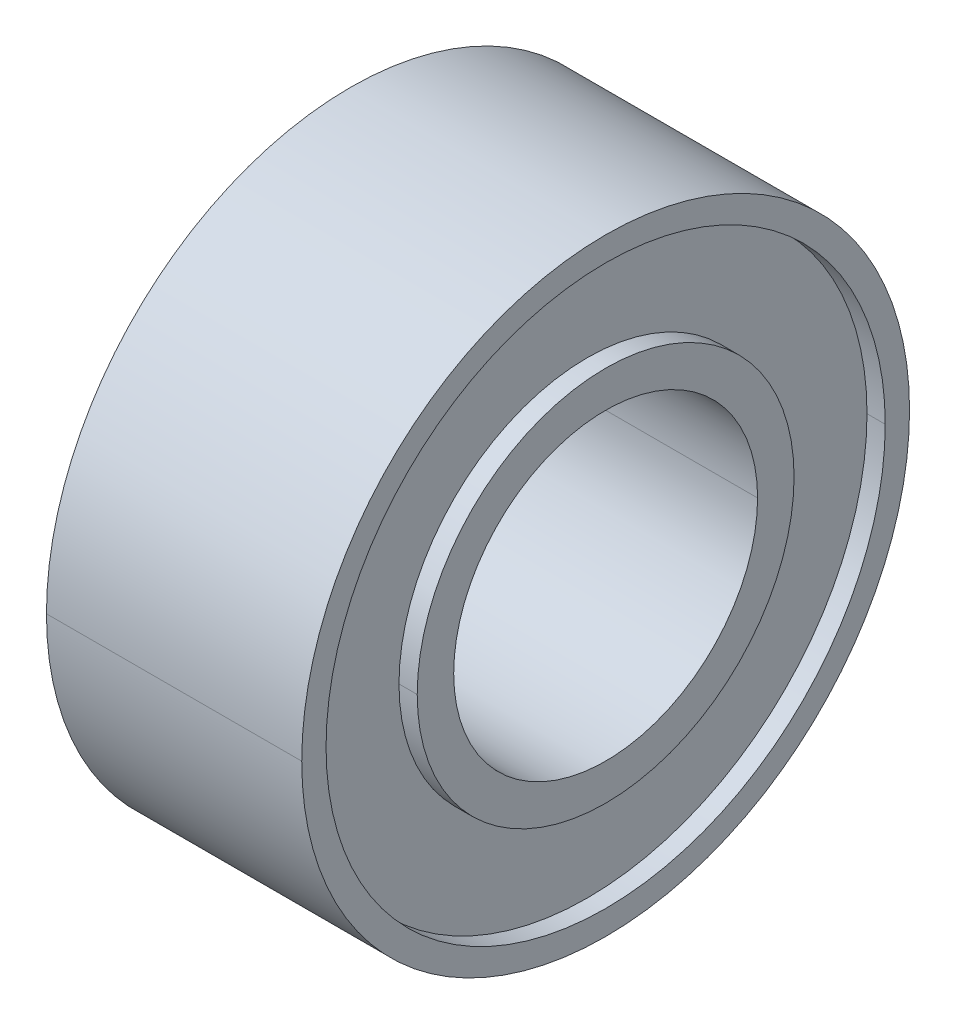
ISO-10303-21;
HEADER;
FILE_DESCRIPTION(('STEP AP214'),'2;1');
FILE_NAME('part.step','',(''),(''),'','','');
FILE_SCHEMA(('AUTOMOTIVE_DESIGN { 1 0 10303 214 1 1 1 1 }'));
ENDSEC;
DATA;
#1=APPLICATION_CONTEXT('core data for automotive mechanical design processes');
#2=APPLICATION_PROTOCOL_DEFINITION('international standard','automotive_design',2000,#1);
#3=PRODUCT_CONTEXT('',#1,'mechanical');
#4=PRODUCT('Part','Part','',(#3));
#5=PRODUCT_RELATED_PRODUCT_CATEGORY('part','',(#4));
#6=PRODUCT_DEFINITION_FORMATION('','',#4);
#7=PRODUCT_DEFINITION_CONTEXT('part definition',#1,'design');
#8=PRODUCT_DEFINITION('design','',#6,#7);
#9=PRODUCT_DEFINITION_SHAPE('','',#8);
#10=(LENGTH_UNIT() NAMED_UNIT(*) SI_UNIT(.MILLI.,.METRE.));
#11=(NAMED_UNIT(*) PLANE_ANGLE_UNIT() SI_UNIT($,.RADIAN.));
#12=(NAMED_UNIT(*) SI_UNIT($,.STERADIAN.) SOLID_ANGLE_UNIT());
#13=UNCERTAINTY_MEASURE_WITH_UNIT(LENGTH_MEASURE(1.E-05),#10,'distance_accuracy_value','');
#14=(GEOMETRIC_REPRESENTATION_CONTEXT(3) GLOBAL_UNCERTAINTY_ASSIGNED_CONTEXT((#13)) GLOBAL_UNIT_ASSIGNED_CONTEXT((#10,
#11,#12)) REPRESENTATION_CONTEXT('',''));
#15=CARTESIAN_POINT('',(0.,0.,0.));
#16=DIRECTION('',(0.,0.,1.));
#17=DIRECTION('',(1.,0.,0.));
#18=AXIS2_PLACEMENT_3D('',#15,#16,#17);
#19=CARTESIAN_POINT('',(0.,0.,0.));
#20=DIRECTION('',(1.,0.,0.));
#21=DIRECTION('',(0.,0.,-1.));
#22=AXIS2_PLACEMENT_3D('',#19,#20,#21);
#23=CYLINDRICAL_SURFACE('',#22,2.5);
#24=DIRECTION('',(1.,0.,0.));
#25=VECTOR('',#24,1.);
#26=CARTESIAN_POINT('',(0.,0.,2.5));
#27=LINE('',#26,#25);
#28=CARTESIAN_POINT('',(-2.1,0.,2.5));
#29=VERTEX_POINT('',#28);
#30=CARTESIAN_POINT('',(2.1,0.,2.5));
#31=VERTEX_POINT('',#30);
#32=EDGE_CURVE('E166',#29,#31,#27,.T.);
#33=ORIENTED_EDGE('',*,*,#32,.F.);
#34=CARTESIAN_POINT('',(-2.1,0.,0.));
#35=DIRECTION('',(1.,0.,0.));
#36=DIRECTION('',(0.,0.,-1.));
#37=AXIS2_PLACEMENT_3D('',#34,#35,#36);
#38=CIRCLE('',#37,2.5);
#39=CARTESIAN_POINT('',(-2.1,0.,-2.5));
#40=VERTEX_POINT('',#39);
#41=EDGE_CURVE('E188',#40,#29,#38,.T.);
#42=ORIENTED_EDGE('',*,*,#41,.F.);
#43=DIRECTION('',(1.,0.,0.));
#44=VECTOR('',#43,1.);
#45=CARTESIAN_POINT('',(0.,0.,-2.5));
#46=LINE('',#45,#44);
#47=CARTESIAN_POINT('',(2.1,0.,-2.5));
#48=VERTEX_POINT('',#47);
#49=EDGE_CURVE('E129',#40,#48,#46,.T.);
#50=ORIENTED_EDGE('',*,*,#49,.T.);
#51=CARTESIAN_POINT('',(2.1,0.,0.));
#52=DIRECTION('',(1.,0.,0.));
#53=DIRECTION('',(0.,0.,-1.));
#54=AXIS2_PLACEMENT_3D('',#51,#52,#53);
#55=CIRCLE('',#54,2.5);
#56=EDGE_CURVE('E11',#48,#31,#55,.T.);
#57=ORIENTED_EDGE('',*,*,#56,.T.);
#58=EDGE_LOOP('',(#33,#42,#50,#57));
#59=FACE_BOUND('',#58,.T.);
#60=ADVANCED_FACE('F17',(#59),#23,.F.);
#61=CARTESIAN_POINT('',(2.1,2.5,0.));
#62=DIRECTION('',(1.,0.,0.));
#63=DIRECTION('',(0.,1.,0.));
#64=AXIS2_PLACEMENT_3D('',#61,#62,#63);
#65=PLANE('',#64);
#66=ORIENTED_EDGE('',*,*,#56,.F.);
#67=CARTESIAN_POINT('',(2.1,0.,0.));
#68=DIRECTION('',(1.,0.,0.));
#69=DIRECTION('',(0.,0.,-1.));
#70=AXIS2_PLACEMENT_3D('',#67,#68,#69);
#71=CIRCLE('',#70,2.5);
#72=EDGE_CURVE('E137',#31,#48,#71,.T.);
#73=ORIENTED_EDGE('',*,*,#72,.F.);
#74=EDGE_LOOP('',(#66,#73));
#75=FACE_BOUND('',#74,.T.);
#76=CARTESIAN_POINT('',(2.1,0.,0.));
#77=DIRECTION('',(1.,0.,0.));
#78=DIRECTION('',(0.,0.,-1.));
#79=AXIS2_PLACEMENT_3D('',#76,#77,#78);
#80=CIRCLE('',#79,3.1);
#81=CARTESIAN_POINT('',(2.1,0.,-3.1));
#82=VERTEX_POINT('',#81);
#83=CARTESIAN_POINT('',(2.1,0.,3.1));
#84=VERTEX_POINT('',#83);
#85=EDGE_CURVE('E122',#82,#84,#80,.T.);
#86=ORIENTED_EDGE('',*,*,#85,.T.);
#87=CARTESIAN_POINT('',(2.1,0.,0.));
#88=DIRECTION('',(1.,0.,0.));
#89=DIRECTION('',(0.,0.,-1.));
#90=AXIS2_PLACEMENT_3D('',#87,#88,#89);
#91=CIRCLE('',#90,3.1);
#92=EDGE_CURVE('E27',#84,#82,#91,.T.);
#93=ORIENTED_EDGE('',*,*,#92,.T.);
#94=EDGE_LOOP('',(#86,#93));
#95=FACE_BOUND('',#94,.T.);
#96=ADVANCED_FACE('F279',(#75,#95),#65,.T.);
#97=CARTESIAN_POINT('',(0.,0.,0.));
#98=DIRECTION('',(1.,0.,0.));
#99=DIRECTION('',(0.,0.,-1.));
#100=AXIS2_PLACEMENT_3D('',#97,#98,#99);
#101=CYLINDRICAL_SURFACE('',#100,3.1);
#102=DIRECTION('',(1.,0.,0.));
#103=VECTOR('',#102,1.);
#104=CARTESIAN_POINT('',(0.,0.,3.1));
#105=LINE('',#104,#103);
#106=CARTESIAN_POINT('',(1.8,0.,3.1));
#107=VERTEX_POINT('',#106);
#108=EDGE_CURVE('E113',#107,#84,#105,.T.);
#109=ORIENTED_EDGE('',*,*,#108,.F.);
#110=CARTESIAN_POINT('',(1.8,0.,0.));
#111=DIRECTION('',(1.,0.,0.));
#112=DIRECTION('',(0.,0.,-1.));
#113=AXIS2_PLACEMENT_3D('',#110,#111,#112);
#114=CIRCLE('',#113,3.1);
#115=CARTESIAN_POINT('',(1.8,0.,-3.1));
#116=VERTEX_POINT('',#115);
#117=EDGE_CURVE('E99',#107,#116,#114,.T.);
#118=ORIENTED_EDGE('',*,*,#117,.T.);
#119=DIRECTION('',(1.,0.,0.));
#120=VECTOR('',#119,1.);
#121=CARTESIAN_POINT('',(0.,0.,-3.1));
#122=LINE('',#121,#120);
#123=EDGE_CURVE('E110',#116,#82,#122,.T.);
#124=ORIENTED_EDGE('',*,*,#123,.T.);
#125=ORIENTED_EDGE('',*,*,#92,.F.);
#126=EDGE_LOOP('',(#109,#118,#124,#125));
#127=FACE_BOUND('',#126,.T.);
#128=ADVANCED_FACE('F109',(#127),#101,.T.);
#129=CARTESIAN_POINT('',(1.8,3.1,0.));
#130=DIRECTION('',(1.,0.,0.));
#131=DIRECTION('',(0.,1.,0.));
#132=AXIS2_PLACEMENT_3D('',#129,#130,#131);
#133=PLANE('',#132);
#134=CARTESIAN_POINT('',(1.8,0.,0.));
#135=DIRECTION('',(1.,0.,0.));
#136=DIRECTION('',(0.,0.,-1.));
#137=AXIS2_PLACEMENT_3D('',#134,#135,#136);
#138=CIRCLE('',#137,3.1);
#139=EDGE_CURVE('E120',#116,#107,#138,.T.);
#140=ORIENTED_EDGE('',*,*,#139,.F.);
#141=ORIENTED_EDGE('',*,*,#117,.F.);
#142=EDGE_LOOP('',(#140,#141));
#143=FACE_BOUND('',#142,.T.);
#144=CARTESIAN_POINT('',(1.8,0.,0.));
#145=DIRECTION('',(1.,0.,0.));
#146=DIRECTION('',(0.,0.,-1.));
#147=AXIS2_PLACEMENT_3D('',#144,#145,#146);
#148=CIRCLE('',#147,4.6);
#149=CARTESIAN_POINT('',(1.8,0.,-4.6));
#150=VERTEX_POINT('',#149);
#151=CARTESIAN_POINT('',(1.8,0.,4.6));
#152=VERTEX_POINT('',#151);
#153=EDGE_CURVE('E116',#150,#152,#148,.T.);
#154=ORIENTED_EDGE('',*,*,#153,.T.);
#155=CARTESIAN_POINT('',(1.8,0.,0.));
#156=DIRECTION('',(1.,0.,0.));
#157=DIRECTION('',(0.,0.,-1.));
#158=AXIS2_PLACEMENT_3D('',#155,#156,#157);
#159=CIRCLE('',#158,4.6);
#160=EDGE_CURVE('E124',#152,#150,#159,.T.);
#161=ORIENTED_EDGE('',*,*,#160,.T.);
#162=EDGE_LOOP('',(#154,#161));
#163=FACE_BOUND('',#162,.T.);
#164=ADVANCED_FACE('F126',(#143,#163),#133,.T.);
#165=CARTESIAN_POINT('',(0.,0.,0.));
#166=DIRECTION('',(1.,0.,0.));
#167=DIRECTION('',(0.,0.,-1.));
#168=AXIS2_PLACEMENT_3D('',#165,#166,#167);
#169=CYLINDRICAL_SURFACE('',#168,4.6);
#170=DIRECTION('',(1.,0.,0.));
#171=VECTOR('',#170,1.);
#172=CARTESIAN_POINT('',(0.,0.,4.6));
#173=LINE('',#172,#171);
#174=CARTESIAN_POINT('',(2.1,0.,4.6));
#175=VERTEX_POINT('',#174);
#176=EDGE_CURVE('E157',#152,#175,#173,.T.);
#177=ORIENTED_EDGE('',*,*,#176,.F.);
#178=ORIENTED_EDGE('',*,*,#153,.F.);
#179=DIRECTION('',(1.,0.,0.));
#180=VECTOR('',#179,1.);
#181=CARTESIAN_POINT('',(0.,0.,-4.6));
#182=LINE('',#181,#180);
#183=CARTESIAN_POINT('',(2.1,0.,-4.6));
#184=VERTEX_POINT('',#183);
#185=EDGE_CURVE('E211',#150,#184,#182,.T.);
#186=ORIENTED_EDGE('',*,*,#185,.T.);
#187=CARTESIAN_POINT('',(2.1,0.,0.));
#188=DIRECTION('',(1.,0.,0.));
#189=DIRECTION('',(0.,0.,-1.));
#190=AXIS2_PLACEMENT_3D('',#187,#188,#189);
#191=CIRCLE('',#190,4.6);
#192=EDGE_CURVE('E20',#184,#175,#191,.T.);
#193=ORIENTED_EDGE('',*,*,#192,.T.);
#194=EDGE_LOOP('',(#177,#178,#186,#193));
#195=FACE_BOUND('',#194,.T.);
#196=ADVANCED_FACE('F257',(#195),#169,.F.);
#197=CARTESIAN_POINT('',(2.1,4.6,0.));
#198=DIRECTION('',(1.,0.,0.));
#199=DIRECTION('',(0.,1.,0.));
#200=AXIS2_PLACEMENT_3D('',#197,#198,#199);
#201=PLANE('',#200);
#202=ORIENTED_EDGE('',*,*,#192,.F.);
#203=CARTESIAN_POINT('',(2.1,0.,0.));
#204=DIRECTION('',(1.,0.,0.));
#205=DIRECTION('',(0.,0.,-1.));
#206=AXIS2_PLACEMENT_3D('',#203,#204,#205);
#207=CIRCLE('',#206,4.6);
#208=EDGE_CURVE('E215',#175,#184,#207,.T.);
#209=ORIENTED_EDGE('',*,*,#208,.F.);
#210=EDGE_LOOP('',(#202,#209));
#211=FACE_BOUND('',#210,.T.);
#212=CARTESIAN_POINT('',(2.1,0.,0.));
#213=DIRECTION('',(1.,0.,0.));
#214=DIRECTION('',(0.,0.,-1.));
#215=AXIS2_PLACEMENT_3D('',#212,#213,#214);
#216=CIRCLE('',#215,5.);
#217=CARTESIAN_POINT('',(2.1,0.,-5.));
#218=VERTEX_POINT('',#217);
#219=CARTESIAN_POINT('',(2.1,0.,5.));
#220=VERTEX_POINT('',#219);
#221=EDGE_CURVE('E179',#218,#220,#216,.T.);
#222=ORIENTED_EDGE('',*,*,#221,.T.);
#223=CARTESIAN_POINT('',(2.1,0.,0.));
#224=DIRECTION('',(1.,0.,0.));
#225=DIRECTION('',(0.,0.,-1.));
#226=AXIS2_PLACEMENT_3D('',#223,#224,#225);
#227=CIRCLE('',#226,5.);
#228=EDGE_CURVE('E210',#220,#218,#227,.T.);
#229=ORIENTED_EDGE('',*,*,#228,.T.);
#230=EDGE_LOOP('',(#222,#229));
#231=FACE_BOUND('',#230,.T.);
#232=ADVANCED_FACE('F264',(#211,#231),#201,.T.);
#233=CARTESIAN_POINT('',(0.,0.,0.));
#234=DIRECTION('',(1.,0.,0.));
#235=DIRECTION('',(0.,0.,-1.));
#236=AXIS2_PLACEMENT_3D('',#233,#234,#235);
#237=CYLINDRICAL_SURFACE('',#236,5.);
#238=DIRECTION('',(1.,0.,0.));
#239=VECTOR('',#238,1.);
#240=CARTESIAN_POINT('',(0.,0.,5.));
#241=LINE('',#240,#239);
#242=CARTESIAN_POINT('',(-2.1,0.,5.));
#243=VERTEX_POINT('',#242);
#244=EDGE_CURVE('E184',#243,#220,#241,.T.);
#245=ORIENTED_EDGE('',*,*,#244,.F.);
#246=CARTESIAN_POINT('',(-2.1,0.,0.));
#247=DIRECTION('',(1.,0.,0.));
#248=DIRECTION('',(0.,0.,-1.));
#249=AXIS2_PLACEMENT_3D('',#246,#247,#248);
#250=CIRCLE('',#249,5.);
#251=CARTESIAN_POINT('',(-2.1,0.,-5.));
#252=VERTEX_POINT('',#251);
#253=EDGE_CURVE('E206',#243,#252,#250,.T.);
#254=ORIENTED_EDGE('',*,*,#253,.T.);
#255=DIRECTION('',(1.,0.,0.));
#256=VECTOR('',#255,1.);
#257=CARTESIAN_POINT('',(0.,0.,-5.));
#258=LINE('',#257,#256);
#259=EDGE_CURVE('E183',#252,#218,#258,.T.);
#260=ORIENTED_EDGE('',*,*,#259,.T.);
#261=ORIENTED_EDGE('',*,*,#228,.F.);
#262=EDGE_LOOP('',(#245,#254,#260,#261));
#263=FACE_BOUND('',#262,.T.);
#264=ADVANCED_FACE('F546',(#263),#237,.T.);
#265=CARTESIAN_POINT('',(-2.1,4.6,0.));
#266=DIRECTION('',(-1.,0.,0.));
#267=DIRECTION('',(0.,0.,1.));
#268=AXIS2_PLACEMENT_3D('',#265,#266,#267);
#269=PLANE('',#268);
#270=CARTESIAN_POINT('',(-2.1,0.,0.));
#271=DIRECTION('',(1.,0.,0.));
#272=DIRECTION('',(0.,0.,-1.));
#273=AXIS2_PLACEMENT_3D('',#270,#271,#272);
#274=CIRCLE('',#273,4.6);
#275=CARTESIAN_POINT('',(-2.1,0.,-4.6));
#276=VERTEX_POINT('',#275);
#277=CARTESIAN_POINT('',(-2.1,0.,4.6));
#278=VERTEX_POINT('',#277);
#279=EDGE_CURVE('E141',#276,#278,#274,.T.);
#280=ORIENTED_EDGE('',*,*,#279,.T.);
#281=CARTESIAN_POINT('',(-2.1,0.,0.));
#282=DIRECTION('',(1.,0.,0.));
#283=DIRECTION('',(0.,0.,-1.));
#284=AXIS2_PLACEMENT_3D('',#281,#282,#283);
#285=CIRCLE('',#284,4.6);
#286=EDGE_CURVE('E160',#278,#276,#285,.T.);
#287=ORIENTED_EDGE('',*,*,#286,.T.);
#288=EDGE_LOOP('',(#280,#287));
#289=FACE_BOUND('',#288,.T.);
#290=CARTESIAN_POINT('',(-2.1,0.,0.));
#291=DIRECTION('',(1.,0.,0.));
#292=DIRECTION('',(0.,0.,-1.));
#293=AXIS2_PLACEMENT_3D('',#290,#291,#292);
#294=CIRCLE('',#293,5.);
#295=EDGE_CURVE('E214',#252,#243,#294,.T.);
#296=ORIENTED_EDGE('',*,*,#295,.F.);
#297=ORIENTED_EDGE('',*,*,#253,.F.);
#298=EDGE_LOOP('',(#296,#297));
#299=FACE_BOUND('',#298,.T.);
#300=ADVANCED_FACE('F330',(#289,#299),#269,.T.);
#301=CARTESIAN_POINT('',(0.,0.,0.));
#302=DIRECTION('',(1.,0.,0.));
#303=DIRECTION('',(0.,0.,-1.));
#304=AXIS2_PLACEMENT_3D('',#301,#302,#303);
#305=CYLINDRICAL_SURFACE('',#304,4.6);
#306=DIRECTION('',(1.,0.,0.));
#307=VECTOR('',#306,1.);
#308=CARTESIAN_POINT('',(0.,0.,4.6));
#309=LINE('',#308,#307);
#310=CARTESIAN_POINT('',(-1.8,0.,4.6));
#311=VERTEX_POINT('',#310);
#312=EDGE_CURVE('E148',#278,#311,#309,.T.);
#313=ORIENTED_EDGE('',*,*,#312,.F.);
#314=ORIENTED_EDGE('',*,*,#279,.F.);
#315=DIRECTION('',(1.,0.,0.));
#316=VECTOR('',#315,1.);
#317=CARTESIAN_POINT('',(0.,0.,-4.6));
#318=LINE('',#317,#316);
#319=CARTESIAN_POINT('',(-1.8,0.,-4.6));
#320=VERTEX_POINT('',#319);
#321=EDGE_CURVE('E147',#276,#320,#318,.T.);
#322=ORIENTED_EDGE('',*,*,#321,.T.);
#323=CARTESIAN_POINT('',(-1.8,0.,0.));
#324=DIRECTION('',(1.,0.,0.));
#325=DIRECTION('',(0.,0.,-1.));
#326=AXIS2_PLACEMENT_3D('',#323,#324,#325);
#327=CIRCLE('',#326,4.6);
#328=EDGE_CURVE('E202',#320,#311,#327,.T.);
#329=ORIENTED_EDGE('',*,*,#328,.T.);
#330=EDGE_LOOP('',(#313,#314,#322,#329));
#331=FACE_BOUND('',#330,.T.);
#332=ADVANCED_FACE('F321',(#331),#305,.F.);
#333=CARTESIAN_POINT('',(-1.8,3.1,0.));
#334=DIRECTION('',(-1.,0.,0.));
#335=DIRECTION('',(0.,0.,1.));
#336=AXIS2_PLACEMENT_3D('',#333,#334,#335);
#337=PLANE('',#336);
#338=CARTESIAN_POINT('',(-1.8,0.,0.));
#339=DIRECTION('',(1.,0.,0.));
#340=DIRECTION('',(0.,0.,-1.));
#341=AXIS2_PLACEMENT_3D('',#338,#339,#340);
#342=CIRCLE('',#341,3.1);
#343=CARTESIAN_POINT('',(-1.8,0.,-3.1));
#344=VERTEX_POINT('',#343);
#345=CARTESIAN_POINT('',(-1.8,0.,3.1));
#346=VERTEX_POINT('',#345);
#347=EDGE_CURVE('E149',#344,#346,#342,.T.);
#348=ORIENTED_EDGE('',*,*,#347,.T.);
#349=CARTESIAN_POINT('',(-1.8,0.,0.));
#350=DIRECTION('',(1.,0.,0.));
#351=DIRECTION('',(0.,0.,-1.));
#352=AXIS2_PLACEMENT_3D('',#349,#350,#351);
#353=CIRCLE('',#352,3.1);
#354=EDGE_CURVE('E41',#346,#344,#353,.T.);
#355=ORIENTED_EDGE('',*,*,#354,.T.);
#356=EDGE_LOOP('',(#348,#355));
#357=FACE_BOUND('',#356,.T.);
#358=ORIENTED_EDGE('',*,*,#328,.F.);
#359=CARTESIAN_POINT('',(-1.8,0.,0.));
#360=DIRECTION('',(1.,0.,0.));
#361=DIRECTION('',(0.,0.,-1.));
#362=AXIS2_PLACEMENT_3D('',#359,#360,#361);
#363=CIRCLE('',#362,4.6);
#364=EDGE_CURVE('E143',#311,#320,#363,.T.);
#365=ORIENTED_EDGE('',*,*,#364,.F.);
#366=EDGE_LOOP('',(#358,#365));
#367=FACE_BOUND('',#366,.T.);
#368=ADVANCED_FACE('F317',(#357,#367),#337,.T.);
#369=CARTESIAN_POINT('',(0.,0.,0.));
#370=DIRECTION('',(1.,0.,0.));
#371=DIRECTION('',(0.,0.,-1.));
#372=AXIS2_PLACEMENT_3D('',#369,#370,#371);
#373=CYLINDRICAL_SURFACE('',#372,3.1);
#374=DIRECTION('',(1.,0.,0.));
#375=VECTOR('',#374,1.);
#376=CARTESIAN_POINT('',(0.,0.,3.1));
#377=LINE('',#376,#375);
#378=CARTESIAN_POINT('',(-2.1,0.,3.1));
#379=VERTEX_POINT('',#378);
#380=EDGE_CURVE('E153',#379,#346,#377,.T.);
#381=ORIENTED_EDGE('',*,*,#380,.F.);
#382=CARTESIAN_POINT('',(-2.1,0.,0.));
#383=DIRECTION('',(1.,0.,0.));
#384=DIRECTION('',(0.,0.,-1.));
#385=AXIS2_PLACEMENT_3D('',#382,#383,#384);
#386=CIRCLE('',#385,3.1);
#387=CARTESIAN_POINT('',(-2.1,0.,-3.1));
#388=VERTEX_POINT('',#387);
#389=EDGE_CURVE('E169',#379,#388,#386,.T.);
#390=ORIENTED_EDGE('',*,*,#389,.T.);
#391=DIRECTION('',(1.,0.,0.));
#392=VECTOR('',#391,1.);
#393=CARTESIAN_POINT('',(0.,0.,-3.1));
#394=LINE('',#393,#392);
#395=EDGE_CURVE('E152',#388,#344,#394,.T.);
#396=ORIENTED_EDGE('',*,*,#395,.T.);
#397=ORIENTED_EDGE('',*,*,#354,.F.);
#398=EDGE_LOOP('',(#381,#390,#396,#397));
#399=FACE_BOUND('',#398,.T.);
#400=ADVANCED_FACE('F490',(#399),#373,.T.);
#401=CARTESIAN_POINT('',(-2.1,2.5,0.));
#402=DIRECTION('',(-1.,0.,0.));
#403=DIRECTION('',(0.,0.,1.));
#404=AXIS2_PLACEMENT_3D('',#401,#402,#403);
#405=PLANE('',#404);
#406=ORIENTED_EDGE('',*,*,#41,.T.);
#407=CARTESIAN_POINT('',(-2.1,0.,0.));
#408=DIRECTION('',(1.,0.,0.));
#409=DIRECTION('',(0.,0.,-1.));
#410=AXIS2_PLACEMENT_3D('',#407,#408,#409);
#411=CIRCLE('',#410,2.5);
#412=EDGE_CURVE('E162',#29,#40,#411,.T.);
#413=ORIENTED_EDGE('',*,*,#412,.T.);
#414=EDGE_LOOP('',(#406,#413));
#415=FACE_BOUND('',#414,.T.);
#416=CARTESIAN_POINT('',(-2.1,0.,0.));
#417=DIRECTION('',(1.,0.,0.));
#418=DIRECTION('',(0.,0.,-1.));
#419=AXIS2_PLACEMENT_3D('',#416,#417,#418);
#420=CIRCLE('',#419,3.1);
#421=EDGE_CURVE('E178',#388,#379,#420,.T.);
#422=ORIENTED_EDGE('',*,*,#421,.F.);
#423=ORIENTED_EDGE('',*,*,#389,.F.);
#424=EDGE_LOOP('',(#422,#423));
#425=FACE_BOUND('',#424,.T.);
#426=ADVANCED_FACE('F297',(#415,#425),#405,.T.);
#427=CARTESIAN_POINT('',(0.,0.,0.));
#428=DIRECTION('',(1.,0.,0.));
#429=DIRECTION('',(0.,0.,-1.));
#430=AXIS2_PLACEMENT_3D('',#427,#428,#429);
#431=CYLINDRICAL_SURFACE('',#430,3.1);
#432=ORIENTED_EDGE('',*,*,#421,.T.);
#433=ORIENTED_EDGE('',*,*,#380,.T.);
#434=ORIENTED_EDGE('',*,*,#347,.F.);
#435=ORIENTED_EDGE('',*,*,#395,.F.);
#436=EDGE_LOOP('',(#432,#433,#434,#435));
#437=FACE_BOUND('',#436,.T.);
#438=ADVANCED_FACE('F489',(#437),#431,.T.);
#439=CARTESIAN_POINT('',(0.,0.,0.));
#440=DIRECTION('',(1.,0.,0.));
#441=DIRECTION('',(0.,0.,-1.));
#442=AXIS2_PLACEMENT_3D('',#439,#440,#441);
#443=CYLINDRICAL_SURFACE('',#442,4.6);
#444=ORIENTED_EDGE('',*,*,#286,.F.);
#445=ORIENTED_EDGE('',*,*,#312,.T.);
#446=ORIENTED_EDGE('',*,*,#364,.T.);
#447=ORIENTED_EDGE('',*,*,#321,.F.);
#448=EDGE_LOOP('',(#444,#445,#446,#447));
#449=FACE_BOUND('',#448,.T.);
#450=ADVANCED_FACE('F325',(#449),#443,.F.);
#451=CARTESIAN_POINT('',(0.,0.,0.));
#452=DIRECTION('',(1.,0.,0.));
#453=DIRECTION('',(0.,0.,-1.));
#454=AXIS2_PLACEMENT_3D('',#451,#452,#453);
#455=CYLINDRICAL_SURFACE('',#454,5.);
#456=ORIENTED_EDGE('',*,*,#295,.T.);
#457=ORIENTED_EDGE('',*,*,#244,.T.);
#458=ORIENTED_EDGE('',*,*,#221,.F.);
#459=ORIENTED_EDGE('',*,*,#259,.F.);
#460=EDGE_LOOP('',(#456,#457,#458,#459));
#461=FACE_BOUND('',#460,.T.);
#462=ADVANCED_FACE('F474',(#461),#455,.T.);
#463=CARTESIAN_POINT('',(0.,0.,0.));
#464=DIRECTION('',(1.,0.,0.));
#465=DIRECTION('',(0.,0.,-1.));
#466=AXIS2_PLACEMENT_3D('',#463,#464,#465);
#467=CYLINDRICAL_SURFACE('',#466,4.6);
#468=ORIENTED_EDGE('',*,*,#160,.F.);
#469=ORIENTED_EDGE('',*,*,#176,.T.);
#470=ORIENTED_EDGE('',*,*,#208,.T.);
#471=ORIENTED_EDGE('',*,*,#185,.F.);
#472=EDGE_LOOP('',(#468,#469,#470,#471));
#473=FACE_BOUND('',#472,.T.);
#474=ADVANCED_FACE('F268',(#473),#467,.F.);
#475=CARTESIAN_POINT('',(0.,0.,0.));
#476=DIRECTION('',(1.,0.,0.));
#477=DIRECTION('',(0.,0.,-1.));
#478=AXIS2_PLACEMENT_3D('',#475,#476,#477);
#479=CYLINDRICAL_SURFACE('',#478,3.1);
#480=ORIENTED_EDGE('',*,*,#139,.T.);
#481=ORIENTED_EDGE('',*,*,#108,.T.);
#482=ORIENTED_EDGE('',*,*,#85,.F.);
#483=ORIENTED_EDGE('',*,*,#123,.F.);
#484=EDGE_LOOP('',(#480,#481,#482,#483));
#485=FACE_BOUND('',#484,.T.);
#486=ADVANCED_FACE('F119',(#485),#479,.T.);
#487=CARTESIAN_POINT('',(0.,0.,0.));
#488=DIRECTION('',(1.,0.,0.));
#489=DIRECTION('',(0.,0.,-1.));
#490=AXIS2_PLACEMENT_3D('',#487,#488,#489);
#491=CYLINDRICAL_SURFACE('',#490,2.5);
#492=ORIENTED_EDGE('',*,*,#412,.F.);
#493=ORIENTED_EDGE('',*,*,#32,.T.);
#494=ORIENTED_EDGE('',*,*,#72,.T.);
#495=ORIENTED_EDGE('',*,*,#49,.F.);
#496=EDGE_LOOP('',(#492,#493,#494,#495));
#497=FACE_BOUND('',#496,.T.);
#498=ADVANCED_FACE('F296',(#497),#491,.F.);
#499=CLOSED_SHELL('',(#60,#96,#128,#164,#196,#232,#264,#300,#332,#368,#400,#426,#438,#450,#462,
#474,#486,#498));
#500=MANIFOLD_SOLID_BREP('B1',#499);
#501=ADVANCED_BREP_SHAPE_REPRESENTATION('',(#18,#500),#14);
#502=SHAPE_DEFINITION_REPRESENTATION(#9,#501);
ENDSEC;
END-ISO-10303-21;
